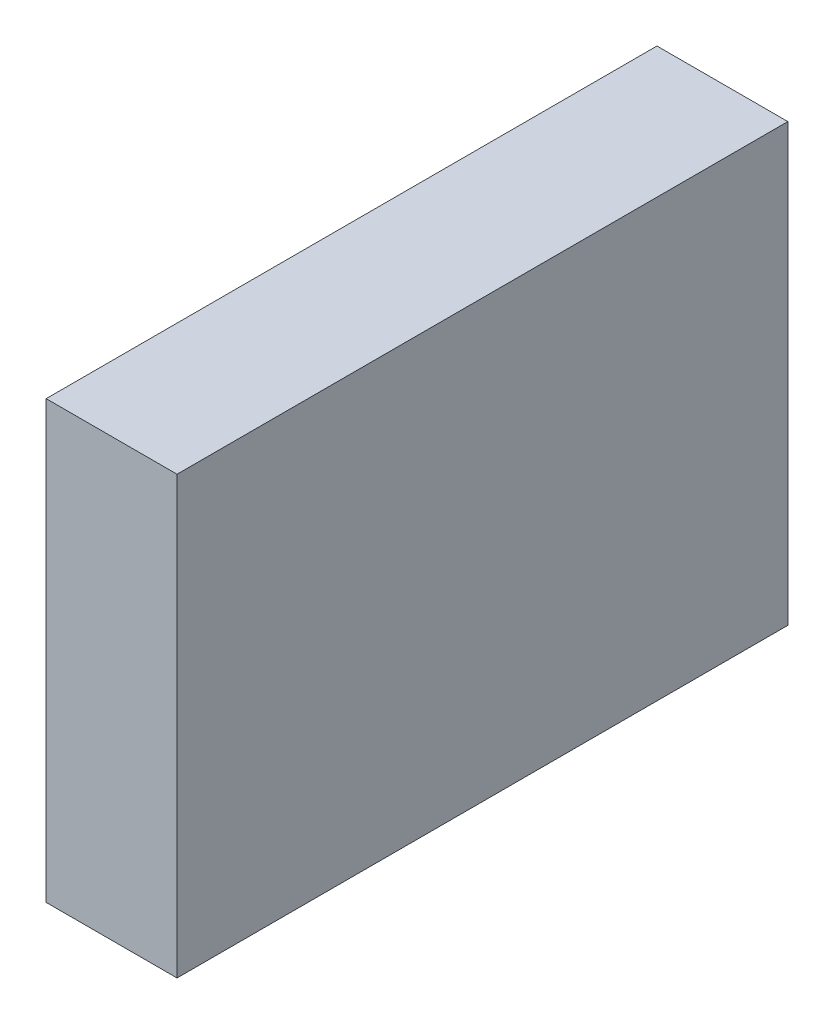
ISO-10303-21;
HEADER;
FILE_DESCRIPTION(('STEP AP214'),'2;1');
FILE_NAME('part.step','',(''),(''),'','','');
FILE_SCHEMA(('AUTOMOTIVE_DESIGN { 1 0 10303 214 1 1 1 1 }'));
ENDSEC;
DATA;
#1=APPLICATION_CONTEXT('core data for automotive mechanical design processes');
#2=APPLICATION_PROTOCOL_DEFINITION('international standard','automotive_design',2000,#1);
#3=PRODUCT_CONTEXT('',#1,'mechanical');
#4=PRODUCT('Part','Part','',(#3));
#5=PRODUCT_RELATED_PRODUCT_CATEGORY('part','',(#4));
#6=PRODUCT_DEFINITION_FORMATION('','',#4);
#7=PRODUCT_DEFINITION_CONTEXT('part definition',#1,'design');
#8=PRODUCT_DEFINITION('design','',#6,#7);
#9=PRODUCT_DEFINITION_SHAPE('','',#8);
#10=(LENGTH_UNIT() NAMED_UNIT(*) SI_UNIT(.MILLI.,.METRE.));
#11=(NAMED_UNIT(*) PLANE_ANGLE_UNIT() SI_UNIT($,.RADIAN.));
#12=(NAMED_UNIT(*) SI_UNIT($,.STERADIAN.) SOLID_ANGLE_UNIT());
#13=UNCERTAINTY_MEASURE_WITH_UNIT(LENGTH_MEASURE(1.E-05),#10,'distance_accuracy_value','');
#14=(GEOMETRIC_REPRESENTATION_CONTEXT(3) GLOBAL_UNCERTAINTY_ASSIGNED_CONTEXT((#13)) GLOBAL_UNIT_ASSIGNED_CONTEXT((#10,
#11,#12)) REPRESENTATION_CONTEXT('',''));
#15=CARTESIAN_POINT('',(0.,0.,0.));
#16=DIRECTION('',(0.,0.,1.));
#17=DIRECTION('',(1.,0.,0.));
#18=AXIS2_PLACEMENT_3D('',#15,#16,#17);
#19=CARTESIAN_POINT('',(-3.90000031821889,-1.81999914063411,-3.72112136188667));
#20=DIRECTION('',(1.,-1.74845553146952E-07,0.));
#21=DIRECTION('',(1.74845553146952E-07,1.,-8.74227765734759E-08));
#22=AXIS2_PLACEMENT_3D('',#19,#20,#21);
#23=PLANE('',#22);
#24=DIRECTION('',(-1.74845553146599E-07,-0.999999999999981,8.74227765732994E-08));
#25=VECTOR('',#24,1.);
#26=CARTESIAN_POINT('',(-3.90000013113414,-0.749999012120625,-2.25112145542904));
#27=LINE('',#26,#25);
#28=CARTESIAN_POINT('',(-3.90000013113414,-0.749999012121625,-2.25112145542904));
#29=VERTEX_POINT('',#28);
#30=CARTESIAN_POINT('',(-3.90000030597969,-1.74999901212262,-2.25112136800726));
#31=VERTEX_POINT('',#30);
#32=EDGE_CURVE('E11',#29,#31,#27,.T.);
#33=ORIENTED_EDGE('',*,*,#32,.T.);
#34=DIRECTION('',(0.,-8.74227764783136E-08,-0.999999999999996));
#35=VECTOR('',#34,1.);
#36=CARTESIAN_POINT('',(-3.90000030597969,-1.74999901212262,-2.25112136800626));
#37=LINE('',#36,#35);
#38=CARTESIAN_POINT('',(-3.9000003059797,-1.74999913451351,-3.65112136800626));
#39=VERTEX_POINT('',#38);
#40=EDGE_CURVE('E69',#31,#39,#37,.T.);
#41=ORIENTED_EDGE('',*,*,#40,.T.);
#42=DIRECTION('',(1.74845553146599E-07,0.999999999999981,-8.74227765732993E-08));
#43=VECTOR('',#42,1.);
#44=CARTESIAN_POINT('',(-3.9000003059797,-1.74999913451451,-3.65112136800626));
#45=LINE('',#44,#43);
#46=CARTESIAN_POINT('',(-3.90000013113415,-0.749999134512512,-3.65112145542804));
#47=VERTEX_POINT('',#46);
#48=EDGE_CURVE('E55',#39,#47,#45,.T.);
#49=ORIENTED_EDGE('',*,*,#48,.T.);
#50=DIRECTION('',(0.,8.74227765576152E-08,0.999999999999996));
#51=VECTOR('',#50,1.);
#52=CARTESIAN_POINT('',(-3.90000013113415,-0.749999134512512,-3.65112145542904));
#53=LINE('',#52,#51);
#54=EDGE_CURVE('E53',#47,#29,#53,.T.);
#55=ORIENTED_EDGE('',*,*,#54,.T.);
#56=EDGE_LOOP('',(#33,#41,#49,#55));
#57=FACE_BOUND('',#56,.T.);
#58=ADVANCED_FACE('F17',(#57),#23,.T.);
#59=CARTESIAN_POINT('',(-4.20000031821889,-1.81999908818044,-3.72112136188667));
#60=DIRECTION('',(1.,-1.74845553146952E-07,0.));
#61=DIRECTION('',(1.74845553146952E-07,1.,-8.74227765734759E-08));
#62=AXIS2_PLACEMENT_3D('',#59,#60,#61);
#63=PLANE('',#62);
#64=DIRECTION('',(0.,8.74227765576152E-08,0.999999999999996));
#65=VECTOR('',#64,1.);
#66=CARTESIAN_POINT('',(-4.20000013113415,-0.749999082058846,-3.65112145542904));
#67=LINE('',#66,#65);
#68=CARTESIAN_POINT('',(-4.20000013113415,-0.749999082058846,-3.65112145542804));
#69=VERTEX_POINT('',#68);
#70=CARTESIAN_POINT('',(-4.20000013113414,-0.749998959667959,-2.25112145542904));
#71=VERTEX_POINT('',#70);
#72=EDGE_CURVE('E24',#69,#71,#67,.T.);
#73=ORIENTED_EDGE('',*,*,#72,.F.);
#74=DIRECTION('',(1.74845553146599E-07,0.999999999999981,-8.74227765732993E-08));
#75=VECTOR('',#74,1.);
#76=CARTESIAN_POINT('',(-4.2000003059797,-1.74999908206085,-3.65112136800627));
#77=LINE('',#76,#75);
#78=CARTESIAN_POINT('',(-4.2000003059797,-1.74999908205985,-3.65112136800627));
#79=VERTEX_POINT('',#78);
#80=EDGE_CURVE('E70',#79,#69,#77,.T.);
#81=ORIENTED_EDGE('',*,*,#80,.F.);
#82=DIRECTION('',(0.,-8.74227766369169E-08,-0.999999999999996));
#83=VECTOR('',#82,1.);
#84=CARTESIAN_POINT('',(-4.20000030597969,-1.74999895966896,-2.25112136800627));
#85=LINE('',#84,#83);
#86=CARTESIAN_POINT('',(-4.20000030597969,-1.74999895966896,-2.25112136800727));
#87=VERTEX_POINT('',#86);
#88=EDGE_CURVE('E59',#87,#79,#85,.T.);
#89=ORIENTED_EDGE('',*,*,#88,.F.);
#90=DIRECTION('',(-1.74845553146599E-07,-0.999999999999981,8.74227765732993E-08));
#91=VECTOR('',#90,1.);
#92=CARTESIAN_POINT('',(-4.20000013113414,-0.749998959666959,-2.25112145542904));
#93=LINE('',#92,#91);
#94=EDGE_CURVE('E78',#71,#87,#93,.T.);
#95=ORIENTED_EDGE('',*,*,#94,.F.);
#96=EDGE_LOOP('',(#73,#81,#89,#95));
#97=FACE_BOUND('',#96,.T.);
#98=ADVANCED_FACE('F89',(#97),#63,.F.);
#99=CARTESIAN_POINT('',(-3.90000013113414,-0.749999012120625,-2.25112145542904));
#100=DIRECTION('',(0.,-8.74227765734759E-08,-1.));
#101=DIRECTION('',(-1.74845553146952E-07,-1.,8.74227765734759E-08));
#102=AXIS2_PLACEMENT_3D('',#99,#100,#101);
#103=PLANE('',#102);
#104=DIRECTION('',(-0.999999999999985,1.74845553220963E-07,0.));
#105=VECTOR('',#104,1.);
#106=CARTESIAN_POINT('',(-3.90000013113414,-0.749999012120625,-2.25112145542904));
#107=LINE('',#106,#105);
#108=EDGE_CURVE('E65',#29,#71,#107,.T.);
#109=ORIENTED_EDGE('',*,*,#108,.T.);
#110=ORIENTED_EDGE('',*,*,#94,.T.);
#111=DIRECTION('',(-0.999999999999985,1.74845552850889E-07,0.));
#112=VECTOR('',#111,1.);
#113=CARTESIAN_POINT('',(-3.90000030597969,-1.74999901212262,-2.25112136800626));
#114=LINE('',#113,#112);
#115=EDGE_CURVE('E66',#31,#87,#114,.T.);
#116=ORIENTED_EDGE('',*,*,#115,.F.);
#117=ORIENTED_EDGE('',*,*,#32,.F.);
#118=EDGE_LOOP('',(#109,#110,#116,#117));
#119=FACE_BOUND('',#118,.T.);
#120=ADVANCED_FACE('F63',(#119),#103,.F.);
#121=CARTESIAN_POINT('',(-3.90000030597969,-1.74999901212262,-2.25112136800626));
#122=DIRECTION('',(1.74845553146952E-07,1.,-8.74227765734759E-08));
#123=DIRECTION('',(0.,-8.74227765734759E-08,-1.));
#124=AXIS2_PLACEMENT_3D('',#121,#122,#123);
#125=PLANE('',#124);
#126=ORIENTED_EDGE('',*,*,#115,.T.);
#127=ORIENTED_EDGE('',*,*,#88,.T.);
#128=DIRECTION('',(-0.999999999999985,1.74845552850889E-07,0.));
#129=VECTOR('',#128,1.);
#130=CARTESIAN_POINT('',(-3.9000003059797,-1.74999913451451,-3.65112136800626));
#131=LINE('',#130,#129);
#132=EDGE_CURVE('E60',#39,#79,#131,.T.);
#133=ORIENTED_EDGE('',*,*,#132,.F.);
#134=ORIENTED_EDGE('',*,*,#40,.F.);
#135=EDGE_LOOP('',(#126,#127,#133,#134));
#136=FACE_BOUND('',#135,.T.);
#137=ADVANCED_FACE('F91',(#136),#125,.F.);
#138=CARTESIAN_POINT('',(-3.9000003059797,-1.74999913451451,-3.65112136800626));
#139=DIRECTION('',(0.,8.74227765734759E-08,1.));
#140=DIRECTION('',(1.74845553146952E-07,1.,-8.74227765734759E-08));
#141=AXIS2_PLACEMENT_3D('',#138,#139,#140);
#142=PLANE('',#141);
#143=ORIENTED_EDGE('',*,*,#132,.T.);
#144=ORIENTED_EDGE('',*,*,#80,.T.);
#145=DIRECTION('',(-0.999999999999985,1.74845553220963E-07,0.));
#146=VECTOR('',#145,1.);
#147=CARTESIAN_POINT('',(-3.90000013113415,-0.749999134512512,-3.65112145542904));
#148=LINE('',#147,#146);
#149=EDGE_CURVE('E84',#47,#69,#148,.T.);
#150=ORIENTED_EDGE('',*,*,#149,.F.);
#151=ORIENTED_EDGE('',*,*,#48,.F.);
#152=EDGE_LOOP('',(#143,#144,#150,#151));
#153=FACE_BOUND('',#152,.T.);
#154=ADVANCED_FACE('F86',(#153),#142,.F.);
#155=CARTESIAN_POINT('',(-3.90000013113415,-0.749999134512512,-3.65112145542904));
#156=DIRECTION('',(-1.74845553146952E-07,-1.,8.74227765734759E-08));
#157=DIRECTION('',(0.,8.74227765734759E-08,1.));
#158=AXIS2_PLACEMENT_3D('',#155,#156,#157);
#159=PLANE('',#158);
#160=ORIENTED_EDGE('',*,*,#149,.T.);
#161=ORIENTED_EDGE('',*,*,#72,.T.);
#162=ORIENTED_EDGE('',*,*,#108,.F.);
#163=ORIENTED_EDGE('',*,*,#54,.F.);
#164=EDGE_LOOP('',(#160,#161,#162,#163));
#165=FACE_BOUND('',#164,.T.);
#166=ADVANCED_FACE('F68',(#165),#159,.F.);
#167=CLOSED_SHELL('',(#58,#98,#120,#137,#154,#166));
#168=MANIFOLD_SOLID_BREP('B1',#167);
#169=ADVANCED_BREP_SHAPE_REPRESENTATION('',(#18,#168),#14);
#170=SHAPE_DEFINITION_REPRESENTATION(#9,#169);
ENDSEC;
END-ISO-10303-21;
